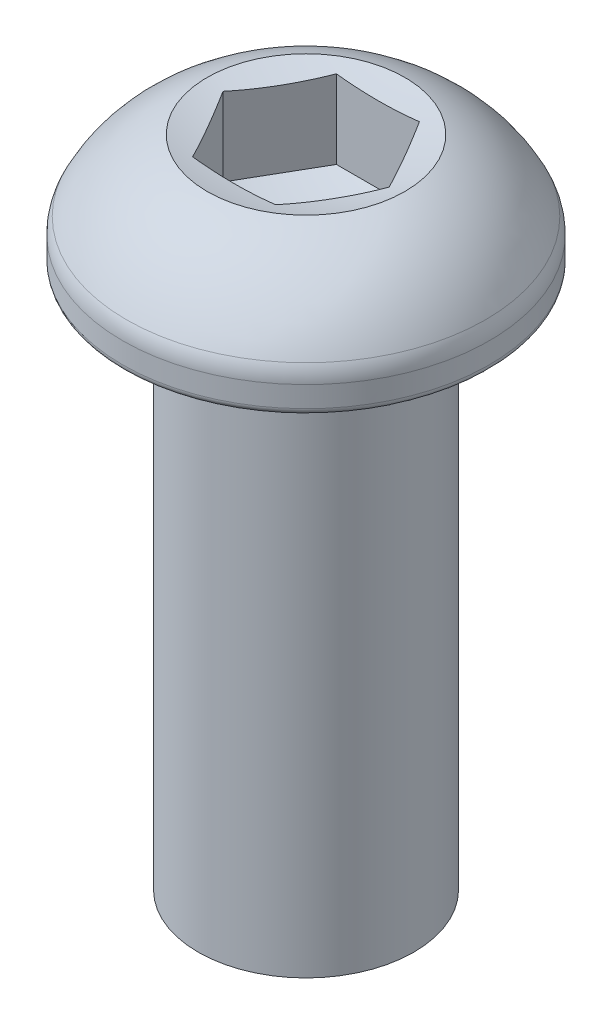
ISO-10303-21;
HEADER;
FILE_DESCRIPTION(('STEP AP214'),'2;1');
FILE_NAME('part.step','',(''),(''),'','','');
FILE_SCHEMA(('AUTOMOTIVE_DESIGN { 1 0 10303 214 1 1 1 1 }'));
ENDSEC;
DATA;
#1=APPLICATION_CONTEXT('core data for automotive mechanical design processes');
#2=APPLICATION_PROTOCOL_DEFINITION('international standard','automotive_design',2000,#1);
#3=PRODUCT_CONTEXT('',#1,'mechanical');
#4=PRODUCT('Part','Part','',(#3));
#5=PRODUCT_RELATED_PRODUCT_CATEGORY('part','',(#4));
#6=PRODUCT_DEFINITION_FORMATION('','',#4);
#7=PRODUCT_DEFINITION_CONTEXT('part definition',#1,'design');
#8=PRODUCT_DEFINITION('design','',#6,#7);
#9=PRODUCT_DEFINITION_SHAPE('','',#8);
#10=(LENGTH_UNIT() NAMED_UNIT(*) SI_UNIT(.MILLI.,.METRE.));
#11=(NAMED_UNIT(*) PLANE_ANGLE_UNIT() SI_UNIT($,.RADIAN.));
#12=(NAMED_UNIT(*) SI_UNIT($,.STERADIAN.) SOLID_ANGLE_UNIT());
#13=UNCERTAINTY_MEASURE_WITH_UNIT(LENGTH_MEASURE(1.E-05),#10,'distance_accuracy_value','');
#14=(GEOMETRIC_REPRESENTATION_CONTEXT(3) GLOBAL_UNCERTAINTY_ASSIGNED_CONTEXT((#13)) GLOBAL_UNIT_ASSIGNED_CONTEXT((#10,
#11,#12)) REPRESENTATION_CONTEXT('',''));
#15=CARTESIAN_POINT('',(0.,0.,0.));
#16=DIRECTION('',(0.,0.,1.));
#17=DIRECTION('',(1.,0.,0.));
#18=AXIS2_PLACEMENT_3D('',#15,#16,#17);
#19=CARTESIAN_POINT('',(0.,-0.573251742610998,0.));
#20=DIRECTION('',(0.,1.,0.));
#21=DIRECTION('',(0.,0.,1.));
#22=AXIS2_PLACEMENT_3D('',#19,#20,#21);
#23=DEGENERATE_TOROIDAL_SURFACE('',#22,1.42238134734289,4.,.T.);
#24=CARTESIAN_POINT('',(0.,1.23062475029976,0.));
#25=DIRECTION('',(0.,-1.,0.));
#26=DIRECTION('',(0.,0.,-1.));
#27=AXIS2_PLACEMENT_3D('',#24,#25,#26);
#28=CIRCLE('',#27,4.9925395508857);
#29=CARTESIAN_POINT('',(0.,1.23062475029976,-4.9925395508857));
#30=VERTEX_POINT('',#29);
#31=EDGE_CURVE('E138',#30,#30,#28,.F.);
#32=ORIENTED_EDGE('',*,*,#31,.T.);
#33=EDGE_LOOP('',(#32));
#34=FACE_BOUND('',#33,.T.);
#35=CARTESIAN_POINT('',(0.,3.2,0.));
#36=DIRECTION('',(0.,1.,0.));
#37=DIRECTION('',(0.,0.,1.));
#38=AXIS2_PLACEMENT_3D('',#35,#36,#37);
#39=CIRCLE('',#38,2.75);
#40=CARTESIAN_POINT('',(0.,3.2,2.75));
#41=VERTEX_POINT('',#40);
#42=EDGE_CURVE('E219',#41,#41,#39,.T.);
#43=ORIENTED_EDGE('',*,*,#42,.F.);
#44=EDGE_LOOP('',(#43));
#45=FACE_BOUND('',#44,.T.);
#46=ADVANCED_FACE('F41',(#34,#45),#23,.T.);
#47=CARTESIAN_POINT('',(0.,55.,0.));
#48=DIRECTION('',(0.,1.,0.));
#49=DIRECTION('',(0.,0.,1.));
#50=AXIS2_PLACEMENT_3D('',#47,#48,#49);
#51=CYLINDRICAL_SURFACE('',#50,5.1);
#52=CARTESIAN_POINT('',(0.,0.779655627072072,0.));
#53=DIRECTION('',(0.,-1.,0.));
#54=DIRECTION('',(0.,0.,-1.));
#55=AXIS2_PLACEMENT_3D('',#52,#53,#54);
#56=CIRCLE('',#55,5.1);
#57=CARTESIAN_POINT('',(0.,0.779655627072072,-5.1));
#58=VERTEX_POINT('',#57);
#59=EDGE_CURVE('E142',#58,#58,#56,.T.);
#60=ORIENTED_EDGE('',*,*,#59,.T.);
#61=EDGE_LOOP('',(#60));
#62=FACE_BOUND('',#61,.T.);
#63=CARTESIAN_POINT('',(0.,0.199999999999999,0.));
#64=DIRECTION('',(0.,1.,0.));
#65=DIRECTION('',(0.,0.,1.));
#66=AXIS2_PLACEMENT_3D('',#63,#64,#65);
#67=CIRCLE('',#66,5.1);
#68=CARTESIAN_POINT('',(0.,0.199999999999999,5.1));
#69=VERTEX_POINT('',#68);
#70=EDGE_CURVE('E130',#69,#69,#67,.T.);
#71=ORIENTED_EDGE('',*,*,#70,.T.);
#72=EDGE_LOOP('',(#71));
#73=FACE_BOUND('',#72,.T.);
#74=ADVANCED_FACE('F155',(#62,#73),#51,.T.);
#75=CARTESIAN_POINT('',(0.,0.,0.));
#76=DIRECTION('',(0.,1.,0.));
#77=DIRECTION('',(0.,0.,1.));
#78=AXIS2_PLACEMENT_3D('',#75,#76,#77);
#79=PLANE('',#78);
#80=CARTESIAN_POINT('',(0.,0.,0.));
#81=DIRECTION('',(0.,1.,0.));
#82=DIRECTION('',(0.,0.,1.));
#83=AXIS2_PLACEMENT_3D('',#80,#81,#82);
#84=CIRCLE('',#83,3.);
#85=CARTESIAN_POINT('',(0.,0.,3.));
#86=VERTEX_POINT('',#85);
#87=EDGE_CURVE('E50',#86,#86,#84,.F.);
#88=ORIENTED_EDGE('',*,*,#87,.F.);
#89=EDGE_LOOP('',(#88));
#90=FACE_BOUND('',#89,.T.);
#91=CARTESIAN_POINT('',(0.,0.,0.));
#92=DIRECTION('',(0.,1.,0.));
#93=DIRECTION('',(0.,0.,1.));
#94=AXIS2_PLACEMENT_3D('',#91,#92,#93);
#95=CIRCLE('',#94,4.9);
#96=CARTESIAN_POINT('',(0.,0.,4.9));
#97=VERTEX_POINT('',#96);
#98=EDGE_CURVE('E134',#97,#97,#95,.F.);
#99=ORIENTED_EDGE('',*,*,#98,.T.);
#100=EDGE_LOOP('',(#99));
#101=FACE_BOUND('',#100,.T.);
#102=ADVANCED_FACE('F151',(#90,#101),#79,.F.);
#103=CARTESIAN_POINT('',(0.,0.199999999999999,0.));
#104=DIRECTION('',(0.,1.,0.));
#105=DIRECTION('',(0.,0.,1.));
#106=AXIS2_PLACEMENT_3D('',#103,#104,#105);
#107=TOROIDAL_SURFACE('',#106,4.9,0.2);
#108=ORIENTED_EDGE('',*,*,#98,.F.);
#109=EDGE_LOOP('',(#108));
#110=FACE_BOUND('',#109,.T.);
#111=ORIENTED_EDGE('',*,*,#70,.F.);
#112=EDGE_LOOP('',(#111));
#113=FACE_BOUND('',#112,.T.);
#114=ADVANCED_FACE('F154',(#110,#113),#107,.T.);
#115=CARTESIAN_POINT('',(0.,0.779655627072072,0.));
#116=DIRECTION('',(0.,-1.,0.));
#117=DIRECTION('',(0.,0.,-1.));
#118=AXIS2_PLACEMENT_3D('',#115,#116,#117);
#119=TOROIDAL_SURFACE('',#118,4.1,1.);
#120=ORIENTED_EDGE('',*,*,#59,.F.);
#121=EDGE_LOOP('',(#120));
#122=FACE_BOUND('',#121,.T.);
#123=ORIENTED_EDGE('',*,*,#31,.F.);
#124=EDGE_LOOP('',(#123));
#125=FACE_BOUND('',#124,.T.);
#126=ADVANCED_FACE('F43',(#122,#125),#119,.T.);
#127=CARTESIAN_POINT('',(0.,-15.,0.));
#128=DIRECTION('',(0.,1.,0.));
#129=DIRECTION('',(0.,0.,1.));
#130=AXIS2_PLACEMENT_3D('',#127,#128,#129);
#131=CYLINDRICAL_SURFACE('',#130,3.);
#132=CARTESIAN_POINT('',(0.,-15.,0.));
#133=DIRECTION('',(0.,-1.,0.));
#134=DIRECTION('',(0.,0.,-1.));
#135=AXIS2_PLACEMENT_3D('',#132,#133,#134);
#136=CIRCLE('',#135,3.);
#137=CARTESIAN_POINT('',(0.,-15.,-3.));
#138=VERTEX_POINT('',#137);
#139=EDGE_CURVE('E126',#138,#138,#136,.T.);
#140=ORIENTED_EDGE('',*,*,#139,.F.);
#141=EDGE_LOOP('',(#140));
#142=FACE_BOUND('',#141,.T.);
#143=ORIENTED_EDGE('',*,*,#87,.T.);
#144=EDGE_LOOP('',(#143));
#145=FACE_BOUND('',#144,.T.);
#146=ADVANCED_FACE('F149',(#142,#145),#131,.T.);
#147=CARTESIAN_POINT('',(0.,-15.,0.));
#148=DIRECTION('',(0.,-1.,0.));
#149=DIRECTION('',(0.,0.,-1.));
#150=AXIS2_PLACEMENT_3D('',#147,#148,#149);
#151=PLANE('',#150);
#152=ORIENTED_EDGE('',*,*,#139,.T.);
#153=EDGE_LOOP('',(#152));
#154=FACE_BOUND('',#153,.T.);
#155=ADVANCED_FACE('F174',(#154),#151,.T.);
#156=CARTESIAN_POINT('',(0.,12.8144422615147,0.));
#157=DIRECTION('',(0.,1.,0.));
#158=DIRECTION('',(1.,0.,0.));
#159=AXIS2_PLACEMENT_3D('',#156,#157,#158);
#160=SPHERICAL_SURFACE('',#159,10.);
#161=ORIENTED_EDGE('',*,*,#42,.T.);
#162=EDGE_LOOP('',(#161));
#163=FACE_BOUND('',#162,.T.);
#164=CARTESIAN_POINT('',(-1.73205080756888,12.8144422615147,1.));
#165=DIRECTION('',(-0.866025403784438,0.,0.5));
#166=DIRECTION('',(0.5,0.,0.866025403784438));
#167=AXIS2_PLACEMENT_3D('',#164,#165,#166);
#168=CIRCLE('',#167,9.79795897113272);
#169=CARTESIAN_POINT('',(-2.3094010767585,3.08476258196376,0.));
#170=VERTEX_POINT('',#169);
#171=CARTESIAN_POINT('',(-1.15470053837925,3.08476258196376,2.));
#172=VERTEX_POINT('',#171);
#173=EDGE_CURVE('E110',#170,#172,#168,.T.);
#174=ORIENTED_EDGE('',*,*,#173,.F.);
#175=CARTESIAN_POINT('',(-1.73205080756888,12.8144422615147,-1.));
#176=DIRECTION('',(-0.866025403784438,0.,-0.5));
#177=DIRECTION('',(-0.5,0.,0.866025403784439));
#178=AXIS2_PLACEMENT_3D('',#175,#176,#177);
#179=CIRCLE('',#178,9.79795897113272);
#180=CARTESIAN_POINT('',(-1.15470053837925,3.08476258196376,-2.));
#181=VERTEX_POINT('',#180);
#182=EDGE_CURVE('E230',#181,#170,#179,.T.);
#183=ORIENTED_EDGE('',*,*,#182,.F.);
#184=CARTESIAN_POINT('',(0.,12.8144422615147,-2.));
#185=DIRECTION('',(0.,0.,-1.));
#186=DIRECTION('',(-1.,0.,0.));
#187=AXIS2_PLACEMENT_3D('',#184,#185,#186);
#188=CIRCLE('',#187,9.79795897113272);
#189=CARTESIAN_POINT('',(1.15470053837925,3.08476258196376,-2.));
#190=VERTEX_POINT('',#189);
#191=EDGE_CURVE('E224',#190,#181,#188,.T.);
#192=ORIENTED_EDGE('',*,*,#191,.F.);
#193=CARTESIAN_POINT('',(1.73205080756888,12.8144422615147,-1.));
#194=DIRECTION('',(0.866025403784438,0.,-0.5));
#195=DIRECTION('',(-0.5,0.,-0.866025403784438));
#196=AXIS2_PLACEMENT_3D('',#193,#194,#195);
#197=CIRCLE('',#196,9.79795897113272);
#198=CARTESIAN_POINT('',(2.3094010767585,3.08476258196376,0.));
#199=VERTEX_POINT('',#198);
#200=EDGE_CURVE('E57',#199,#190,#197,.T.);
#201=ORIENTED_EDGE('',*,*,#200,.F.);
#202=CARTESIAN_POINT('',(1.73205080756888,12.8144422615147,1.));
#203=DIRECTION('',(0.866025403784439,0.,0.5));
#204=DIRECTION('',(0.5,0.,-0.866025403784439));
#205=AXIS2_PLACEMENT_3D('',#202,#203,#204);
#206=CIRCLE('',#205,9.79795897113272);
#207=CARTESIAN_POINT('',(1.15470053837925,3.08476258196376,2.));
#208=VERTEX_POINT('',#207);
#209=EDGE_CURVE('E11',#208,#199,#206,.T.);
#210=ORIENTED_EDGE('',*,*,#209,.F.);
#211=CARTESIAN_POINT('',(0.,12.8144422615147,2.));
#212=DIRECTION('',(0.,0.,1.));
#213=DIRECTION('',(1.,0.,0.));
#214=AXIS2_PLACEMENT_3D('',#211,#212,#213);
#215=CIRCLE('',#214,9.79795897113272);
#216=EDGE_CURVE('E93',#172,#208,#215,.T.);
#217=ORIENTED_EDGE('',*,*,#216,.F.);
#218=EDGE_LOOP('',(#174,#183,#192,#201,#210,#217));
#219=FACE_BOUND('',#218,.T.);
#220=ADVANCED_FACE('F92',(#163,#219),#160,.F.);
#221=CARTESIAN_POINT('',(0.,0.5,0.));
#222=DIRECTION('',(0.,1.,0.));
#223=DIRECTION('',(0.,0.,1.));
#224=AXIS2_PLACEMENT_3D('',#221,#222,#223);
#225=PLANE('',#224);
#226=CARTESIAN_POINT('',(0.,0.5,0.));
#227=DIRECTION('',(0.,1.,0.));
#228=DIRECTION('',(0.,0.,1.));
#229=AXIS2_PLACEMENT_3D('',#226,#227,#228);
#230=CIRCLE('',#229,0.25);
#231=CARTESIAN_POINT('',(0.,0.5,0.25));
#232=VERTEX_POINT('',#231);
#233=EDGE_CURVE('E238',#232,#232,#230,.T.);
#234=ORIENTED_EDGE('',*,*,#233,.T.);
#235=EDGE_LOOP('',(#234));
#236=FACE_BOUND('',#235,.T.);
#237=ADVANCED_FACE('F206',(#236),#225,.T.);
#238=CARTESIAN_POINT('',(0.,6.0014159936926,0.));
#239=DIRECTION('',(0.,1.,0.));
#240=DIRECTION('',(0.,0.,1.));
#241=AXIS2_PLACEMENT_3D('',#238,#239,#240);
#242=DEGENERATE_TOROIDAL_SURFACE('',#241,0.25,5.5014159936926,.T.);
#243=CARTESIAN_POINT('',(0.,0.899999999999998,0.));
#244=DIRECTION('',(0.,1.,0.));
#245=DIRECTION('',(0.,0.,1.));
#246=AXIS2_PLACEMENT_3D('',#243,#244,#245);
#247=CIRCLE('',#246,2.3094010767585);
#248=CARTESIAN_POINT('',(1.15470053837925,0.9,2.));
#249=VERTEX_POINT('',#248);
#250=CARTESIAN_POINT('',(2.3094010767585,0.899999999999998,0.));
#251=VERTEX_POINT('',#250);
#252=EDGE_CURVE('E63',#249,#251,#247,.T.);
#253=ORIENTED_EDGE('',*,*,#252,.T.);
#254=CARTESIAN_POINT('',(1.15470053837925,0.899999999999998,-2.));
#255=VERTEX_POINT('',#254);
#256=EDGE_CURVE('E239',#251,#255,#247,.T.);
#257=ORIENTED_EDGE('',*,*,#256,.T.);
#258=CARTESIAN_POINT('',(-1.15470053837925,0.899999999999998,-2.));
#259=VERTEX_POINT('',#258);
#260=EDGE_CURVE('E279',#255,#259,#247,.T.);
#261=ORIENTED_EDGE('',*,*,#260,.T.);
#262=CARTESIAN_POINT('',(-2.3094010767585,0.899999999999998,0.));
#263=VERTEX_POINT('',#262);
#264=EDGE_CURVE('E284',#259,#263,#247,.T.);
#265=ORIENTED_EDGE('',*,*,#264,.T.);
#266=CARTESIAN_POINT('',(-1.15470053837925,0.899999999999998,2.));
#267=VERTEX_POINT('',#266);
#268=EDGE_CURVE('E289',#263,#267,#247,.T.);
#269=ORIENTED_EDGE('',*,*,#268,.T.);
#270=EDGE_CURVE('E109',#267,#249,#247,.T.);
#271=ORIENTED_EDGE('',*,*,#270,.T.);
#272=EDGE_LOOP('',(#253,#257,#261,#265,#269,#271));
#273=FACE_BOUND('',#272,.T.);
#274=ORIENTED_EDGE('',*,*,#233,.F.);
#275=EDGE_LOOP('',(#274));
#276=FACE_BOUND('',#275,.T.);
#277=ADVANCED_FACE('F204',(#273,#276),#242,.F.);
#278=CARTESIAN_POINT('',(0.,0.899999999999999,0.));
#279=DIRECTION('',(0.,-1.,0.));
#280=DIRECTION('',(0.,0.,-1.));
#281=AXIS2_PLACEMENT_3D('',#278,#279,#280);
#282=PLANE('',#281);
#283=DIRECTION('',(1.,0.,0.));
#284=VECTOR('',#283,1.);
#285=CARTESIAN_POINT('',(-1.15470053837925,0.9,2.));
#286=LINE('',#285,#284);
#287=EDGE_CURVE('E243',#267,#249,#286,.T.);
#288=ORIENTED_EDGE('',*,*,#287,.T.);
#289=ORIENTED_EDGE('',*,*,#270,.F.);
#290=EDGE_LOOP('',(#288,#289));
#291=FACE_BOUND('',#290,.T.);
#292=ADVANCED_FACE('F200',(#291),#282,.T.);
#293=DIRECTION('',(0.5,0.,0.866025403784438));
#294=VECTOR('',#293,1.);
#295=CARTESIAN_POINT('',(-2.3094010767585,0.9,0.));
#296=LINE('',#295,#294);
#297=EDGE_CURVE('E116',#263,#267,#296,.T.);
#298=ORIENTED_EDGE('',*,*,#297,.T.);
#299=ORIENTED_EDGE('',*,*,#268,.F.);
#300=EDGE_LOOP('',(#298,#299));
#301=FACE_BOUND('',#300,.T.);
#302=ADVANCED_FACE('F203',(#301),#282,.T.);
#303=DIRECTION('',(-0.5,0.,0.866025403784439));
#304=VECTOR('',#303,1.);
#305=CARTESIAN_POINT('',(-1.15470053837925,0.9,-2.));
#306=LINE('',#305,#304);
#307=EDGE_CURVE('E122',#259,#263,#306,.T.);
#308=ORIENTED_EDGE('',*,*,#307,.T.);
#309=ORIENTED_EDGE('',*,*,#264,.F.);
#310=EDGE_LOOP('',(#308,#309));
#311=FACE_BOUND('',#310,.T.);
#312=ADVANCED_FACE('F299',(#311),#282,.T.);
#313=DIRECTION('',(-1.,0.,0.));
#314=VECTOR('',#313,1.);
#315=CARTESIAN_POINT('',(1.15470053837925,0.9,-2.));
#316=LINE('',#315,#314);
#317=EDGE_CURVE('E252',#255,#259,#316,.T.);
#318=ORIENTED_EDGE('',*,*,#317,.T.);
#319=ORIENTED_EDGE('',*,*,#260,.F.);
#320=EDGE_LOOP('',(#318,#319));
#321=FACE_BOUND('',#320,.T.);
#322=ADVANCED_FACE('F280',(#321),#282,.T.);
#323=DIRECTION('',(-0.5,0.,-0.866025403784438));
#324=VECTOR('',#323,1.);
#325=CARTESIAN_POINT('',(2.3094010767585,0.9,0.));
#326=LINE('',#325,#324);
#327=EDGE_CURVE('E249',#251,#255,#326,.T.);
#328=ORIENTED_EDGE('',*,*,#327,.T.);
#329=ORIENTED_EDGE('',*,*,#256,.F.);
#330=EDGE_LOOP('',(#328,#329));
#331=FACE_BOUND('',#330,.T.);
#332=ADVANCED_FACE('F275',(#331),#282,.T.);
#333=DIRECTION('',(0.5,0.,-0.866025403784439));
#334=VECTOR('',#333,1.);
#335=CARTESIAN_POINT('',(1.15470053837925,0.9,2.));
#336=LINE('',#335,#334);
#337=EDGE_CURVE('E113',#249,#251,#336,.T.);
#338=ORIENTED_EDGE('',*,*,#337,.T.);
#339=ORIENTED_EDGE('',*,*,#252,.F.);
#340=EDGE_LOOP('',(#338,#339));
#341=FACE_BOUND('',#340,.T.);
#342=ADVANCED_FACE('F185',(#341),#282,.T.);
#343=CARTESIAN_POINT('',(1.15470053837925,0.9,2.));
#344=DIRECTION('',(0.866025403784439,0.,0.5));
#345=DIRECTION('',(0.5,0.,-0.866025403784439));
#346=AXIS2_PLACEMENT_3D('',#343,#344,#345);
#347=PLANE('',#346);
#348=DIRECTION('',(0.,1.,0.));
#349=VECTOR('',#348,1.);
#350=CARTESIAN_POINT('',(1.15470053837925,0.9,2.));
#351=LINE('',#350,#349);
#352=EDGE_CURVE('E104',#249,#208,#351,.T.);
#353=ORIENTED_EDGE('',*,*,#352,.T.);
#354=ORIENTED_EDGE('',*,*,#209,.T.);
#355=DIRECTION('',(0.,1.,0.));
#356=VECTOR('',#355,1.);
#357=CARTESIAN_POINT('',(2.3094010767585,0.9,0.));
#358=LINE('',#357,#356);
#359=EDGE_CURVE('E115',#251,#199,#358,.T.);
#360=ORIENTED_EDGE('',*,*,#359,.F.);
#361=ORIENTED_EDGE('',*,*,#337,.F.);
#362=EDGE_LOOP('',(#353,#354,#360,#361));
#363=FACE_BOUND('',#362,.T.);
#364=ADVANCED_FACE('F112',(#363),#347,.F.);
#365=CARTESIAN_POINT('',(2.3094010767585,0.9,0.));
#366=DIRECTION('',(0.866025403784438,0.,-0.5));
#367=DIRECTION('',(-0.5,0.,-0.866025403784438));
#368=AXIS2_PLACEMENT_3D('',#365,#366,#367);
#369=PLANE('',#368);
#370=ORIENTED_EDGE('',*,*,#359,.T.);
#371=ORIENTED_EDGE('',*,*,#200,.T.);
#372=DIRECTION('',(0.,1.,0.));
#373=VECTOR('',#372,1.);
#374=CARTESIAN_POINT('',(1.15470053837925,0.9,-2.));
#375=LINE('',#374,#373);
#376=EDGE_CURVE('E120',#255,#190,#375,.T.);
#377=ORIENTED_EDGE('',*,*,#376,.F.);
#378=ORIENTED_EDGE('',*,*,#327,.F.);
#379=EDGE_LOOP('',(#370,#371,#377,#378));
#380=FACE_BOUND('',#379,.T.);
#381=ADVANCED_FACE('F184',(#380),#369,.F.);
#382=CARTESIAN_POINT('',(1.15470053837925,0.9,-2.));
#383=DIRECTION('',(0.,0.,-1.));
#384=DIRECTION('',(-1.,0.,0.));
#385=AXIS2_PLACEMENT_3D('',#382,#383,#384);
#386=PLANE('',#385);
#387=ORIENTED_EDGE('',*,*,#376,.T.);
#388=ORIENTED_EDGE('',*,*,#191,.T.);
#389=DIRECTION('',(0.,1.,0.));
#390=VECTOR('',#389,1.);
#391=CARTESIAN_POINT('',(-1.15470053837925,0.9,-2.));
#392=LINE('',#391,#390);
#393=EDGE_CURVE('E263',#259,#181,#392,.T.);
#394=ORIENTED_EDGE('',*,*,#393,.F.);
#395=ORIENTED_EDGE('',*,*,#317,.F.);
#396=EDGE_LOOP('',(#387,#388,#394,#395));
#397=FACE_BOUND('',#396,.T.);
#398=ADVANCED_FACE('F188',(#397),#386,.F.);
#399=CARTESIAN_POINT('',(-1.15470053837925,0.9,-2.));
#400=DIRECTION('',(-0.866025403784438,0.,-0.5));
#401=DIRECTION('',(-0.5,0.,0.866025403784439));
#402=AXIS2_PLACEMENT_3D('',#399,#400,#401);
#403=PLANE('',#402);
#404=ORIENTED_EDGE('',*,*,#393,.T.);
#405=ORIENTED_EDGE('',*,*,#182,.T.);
#406=DIRECTION('',(0.,1.,0.));
#407=VECTOR('',#406,1.);
#408=CARTESIAN_POINT('',(-2.3094010767585,0.9,0.));
#409=LINE('',#408,#407);
#410=EDGE_CURVE('E259',#263,#170,#409,.T.);
#411=ORIENTED_EDGE('',*,*,#410,.F.);
#412=ORIENTED_EDGE('',*,*,#307,.F.);
#413=EDGE_LOOP('',(#404,#405,#411,#412));
#414=FACE_BOUND('',#413,.T.);
#415=ADVANCED_FACE('F192',(#414),#403,.F.);
#416=CARTESIAN_POINT('',(-2.3094010767585,0.9,0.));
#417=DIRECTION('',(-0.866025403784438,0.,0.5));
#418=DIRECTION('',(0.5,0.,0.866025403784438));
#419=AXIS2_PLACEMENT_3D('',#416,#417,#418);
#420=PLANE('',#419);
#421=ORIENTED_EDGE('',*,*,#410,.T.);
#422=ORIENTED_EDGE('',*,*,#173,.T.);
#423=DIRECTION('',(0.,1.,0.));
#424=VECTOR('',#423,1.);
#425=CARTESIAN_POINT('',(-1.15470053837925,0.9,2.));
#426=LINE('',#425,#424);
#427=EDGE_CURVE('E107',#267,#172,#426,.T.);
#428=ORIENTED_EDGE('',*,*,#427,.F.);
#429=ORIENTED_EDGE('',*,*,#297,.F.);
#430=EDGE_LOOP('',(#421,#422,#428,#429));
#431=FACE_BOUND('',#430,.T.);
#432=ADVANCED_FACE('F181',(#431),#420,.F.);
#433=CARTESIAN_POINT('',(-1.15470053837925,0.9,2.));
#434=DIRECTION('',(0.,0.,1.));
#435=DIRECTION('',(1.,0.,0.));
#436=AXIS2_PLACEMENT_3D('',#433,#434,#435);
#437=PLANE('',#436);
#438=ORIENTED_EDGE('',*,*,#427,.T.);
#439=ORIENTED_EDGE('',*,*,#216,.T.);
#440=ORIENTED_EDGE('',*,*,#352,.F.);
#441=ORIENTED_EDGE('',*,*,#287,.F.);
#442=EDGE_LOOP('',(#438,#439,#440,#441));
#443=FACE_BOUND('',#442,.T.);
#444=ADVANCED_FACE('F102',(#443),#437,.F.);
#445=CLOSED_SHELL('',(#46,#74,#102,#114,#126,#146,#155,#220,#237,#277,#292,#302,#312,#322,#332,
#342,#364,#381,#398,#415,#432,#444));
#446=MANIFOLD_SOLID_BREP('B2',#445);
#447=ADVANCED_BREP_SHAPE_REPRESENTATION('',(#18,#446),#14);
#448=SHAPE_DEFINITION_REPRESENTATION(#9,#447);
ENDSEC;
END-ISO-10303-21;
